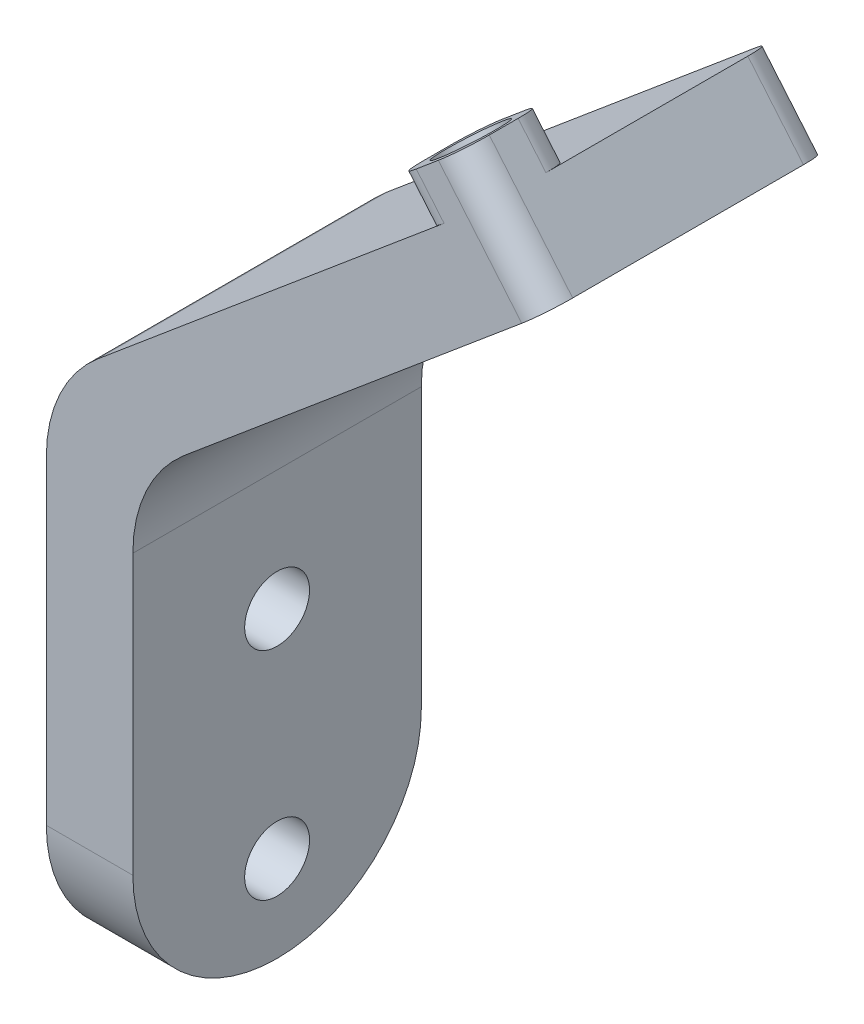
ISO-10303-21;
HEADER;
FILE_DESCRIPTION(('STEP AP214'),'2;1');
FILE_NAME('part.step','',(''),(''),'','','');
FILE_SCHEMA(('AUTOMOTIVE_DESIGN { 1 0 10303 214 1 1 1 1 }'));
ENDSEC;
DATA;
#1=APPLICATION_CONTEXT('core data for automotive mechanical design processes');
#2=APPLICATION_PROTOCOL_DEFINITION('international standard','automotive_design',2000,#1);
#3=PRODUCT_CONTEXT('',#1,'mechanical');
#4=PRODUCT('Part','Part','',(#3));
#5=PRODUCT_RELATED_PRODUCT_CATEGORY('part','',(#4));
#6=PRODUCT_DEFINITION_FORMATION('','',#4);
#7=PRODUCT_DEFINITION_CONTEXT('part definition',#1,'design');
#8=PRODUCT_DEFINITION('design','',#6,#7);
#9=PRODUCT_DEFINITION_SHAPE('','',#8);
#10=(LENGTH_UNIT() NAMED_UNIT(*) SI_UNIT(.MILLI.,.METRE.));
#11=(NAMED_UNIT(*) PLANE_ANGLE_UNIT() SI_UNIT($,.RADIAN.));
#12=(NAMED_UNIT(*) SI_UNIT($,.STERADIAN.) SOLID_ANGLE_UNIT());
#13=UNCERTAINTY_MEASURE_WITH_UNIT(LENGTH_MEASURE(1.E-05),#10,'distance_accuracy_value','');
#14=(GEOMETRIC_REPRESENTATION_CONTEXT(3) GLOBAL_UNCERTAINTY_ASSIGNED_CONTEXT((#13)) GLOBAL_UNIT_ASSIGNED_CONTEXT((#10,
#11,#12)) REPRESENTATION_CONTEXT('',''));
#15=CARTESIAN_POINT('',(0.,0.,0.));
#16=DIRECTION('',(0.,0.,1.));
#17=DIRECTION('',(1.,0.,0.));
#18=AXIS2_PLACEMENT_3D('',#15,#16,#17);
#19=CARTESIAN_POINT('',(0.,36.79784594893,-20.));
#20=DIRECTION('',(0.642787609686538,-0.766044443118979,0.));
#21=DIRECTION('',(0.766044443118979,0.642787609686538,0.));
#22=AXIS2_PLACEMENT_3D('',#19,#20,#21);
#23=PLANE('',#22);
#24=DIRECTION('',(-0.766044443118979,-0.642787609686538,0.));
#25=VECTOR('',#24,1.);
#26=CARTESIAN_POINT('',(0.,36.79784594893,-20.));
#27=LINE('',#26,#25);
#28=CARTESIAN_POINT('',(29.1096888385212,61.2237751170184,-20.));
#29=VERTEX_POINT('',#28);
#30=CARTESIAN_POINT('',(3.57212390313463,39.7952137985698,-20.));
#31=VERTEX_POINT('',#30);
#32=EDGE_CURVE('E317',#29,#31,#27,.T.);
#33=ORIENTED_EDGE('',*,*,#32,.T.);
#34=DIRECTION('',(0.,0.,1.));
#35=VECTOR('',#34,1.);
#36=CARTESIAN_POINT('',(3.57212390313463,39.7952137985698,-20.));
#37=LINE('',#36,#35);
#38=CARTESIAN_POINT('',(3.57212390313463,39.7952137985698,0.));
#39=VERTEX_POINT('',#38);
#40=EDGE_CURVE('E223',#39,#31,#37,.F.);
#41=ORIENTED_EDGE('',*,*,#40,.F.);
#42=DIRECTION('',(-0.766044443118979,-0.642787609686538,0.));
#43=VECTOR('',#42,1.);
#44=CARTESIAN_POINT('',(0.,36.79784594893,0.));
#45=LINE('',#44,#43);
#46=CARTESIAN_POINT('',(27.5775999522833,59.9381998976454,0.));
#47=VERTEX_POINT('',#46);
#48=EDGE_CURVE('E182',#47,#39,#45,.T.);
#49=ORIENTED_EDGE('',*,*,#48,.F.);
#50=CARTESIAN_POINT('',(27.5775999522833,59.9381998976454,-2.));
#51=DIRECTION('',(-0.642787609686538,0.766044443118979,0.));
#52=DIRECTION('',(0.766044443118979,0.642787609686538,0.));
#53=AXIS2_PLACEMENT_3D('',#50,#51,#52);
#54=CIRCLE('',#53,2.);
#55=CARTESIAN_POINT('',(26.0455110660453,58.6526246782723,-2.));
#56=VERTEX_POINT('',#55);
#57=EDGE_CURVE('E43',#56,#47,#54,.T.);
#58=ORIENTED_EDGE('',*,*,#57,.F.);
#59=DIRECTION('',(0.,0.,-1.));
#60=VECTOR('',#59,1.);
#61=CARTESIAN_POINT('',(26.0455110660453,58.6526246782723,-6.));
#62=LINE('',#61,#60);
#63=CARTESIAN_POINT('',(26.0455110660453,58.6526246782723,-4.));
#64=VERTEX_POINT('',#63);
#65=EDGE_CURVE('E298',#56,#64,#62,.T.);
#66=ORIENTED_EDGE('',*,*,#65,.T.);
#67=CARTESIAN_POINT('',(27.5775999522833,59.9381998976454,-4.));
#68=DIRECTION('',(-0.642787609686538,0.766044443118979,0.));
#69=DIRECTION('',(0.766044443118979,0.642787609686538,0.));
#70=AXIS2_PLACEMENT_3D('',#67,#68,#69);
#71=CIRCLE('',#70,2.);
#72=CARTESIAN_POINT('',(27.5775999522833,59.9381998976453,-6.));
#73=VERTEX_POINT('',#72);
#74=EDGE_CURVE('E11',#73,#64,#71,.T.);
#75=ORIENTED_EDGE('',*,*,#74,.F.);
#76=DIRECTION('',(0.766044443118979,0.642787609686538,0.));
#77=VECTOR('',#76,1.);
#78=CARTESIAN_POINT('',(30.6417777247592,62.5093503363915,-6.));
#79=LINE('',#78,#77);
#80=CARTESIAN_POINT('',(29.1096888385212,61.2237751170184,-6.));
#81=VERTEX_POINT('',#80);
#82=EDGE_CURVE('E291',#73,#81,#79,.T.);
#83=ORIENTED_EDGE('',*,*,#82,.T.);
#84=CARTESIAN_POINT('',(29.1096888385212,61.2237751170184,-4.));
#85=DIRECTION('',(-0.642787609686538,0.766044443118979,0.));
#86=DIRECTION('',(0.766044443118979,0.642787609686538,0.));
#87=AXIS2_PLACEMENT_3D('',#84,#85,#86);
#88=CIRCLE('',#87,2.);
#89=CARTESIAN_POINT('',(30.6417777247592,62.5093503363915,-4.));
#90=VERTEX_POINT('',#89);
#91=EDGE_CURVE('E267',#90,#81,#88,.T.);
#92=ORIENTED_EDGE('',*,*,#91,.F.);
#93=DIRECTION('',(0.,0.,1.));
#94=VECTOR('',#93,1.);
#95=CARTESIAN_POINT('',(30.6417777247592,62.5093503363915,-20.));
#96=LINE('',#95,#94);
#97=CARTESIAN_POINT('',(30.6417777247592,62.5093503363915,-18.));
#98=VERTEX_POINT('',#97);
#99=EDGE_CURVE('E193',#98,#90,#96,.T.);
#100=ORIENTED_EDGE('',*,*,#99,.F.);
#101=CARTESIAN_POINT('',(29.1096888385212,61.2237751170184,-18.));
#102=DIRECTION('',(-0.642787609686538,0.766044443118979,0.));
#103=DIRECTION('',(0.766044443118979,0.642787609686538,0.));
#104=AXIS2_PLACEMENT_3D('',#101,#102,#103);
#105=CIRCLE('',#104,2.);
#106=EDGE_CURVE('E265',#29,#98,#105,.F.);
#107=ORIENTED_EDGE('',*,*,#106,.F.);
#108=EDGE_LOOP('',(#33,#41,#49,#58,#66,#75,#83,#92,#100,#107));
#109=FACE_BOUND('',#108,.T.);
#110=ADVANCED_FACE('F35',(#109),#23,.F.);
#111=CARTESIAN_POINT('',(6.,34.,-20.));
#112=DIRECTION('',(-1.,0.,0.));
#113=DIRECTION('',(0.,-1.,0.));
#114=AXIS2_PLACEMENT_3D('',#111,#112,#113);
#115=PLANE('',#114);
#116=CARTESIAN_POINT('',(6.,21.,-10.));
#117=DIRECTION('',(1.,0.,0.));
#118=DIRECTION('',(0.,-1.,0.));
#119=AXIS2_PLACEMENT_3D('',#116,#117,#118);
#120=CIRCLE('',#119,2.25);
#121=CARTESIAN_POINT('',(6.,18.75,-10.));
#122=VERTEX_POINT('',#121);
#123=EDGE_CURVE('E305',#122,#122,#120,.T.);
#124=ORIENTED_EDGE('',*,*,#123,.F.);
#125=EDGE_LOOP('',(#124));
#126=FACE_BOUND('',#125,.T.);
#127=CARTESIAN_POINT('',(6.,6.,-10.));
#128=DIRECTION('',(1.,0.,0.));
#129=DIRECTION('',(0.,-1.,0.));
#130=AXIS2_PLACEMENT_3D('',#127,#128,#129);
#131=CIRCLE('',#130,2.25);
#132=CARTESIAN_POINT('',(6.,3.75,-10.));
#133=VERTEX_POINT('',#132);
#134=EDGE_CURVE('E186',#133,#133,#131,.T.);
#135=ORIENTED_EDGE('',*,*,#134,.F.);
#136=EDGE_LOOP('',(#135));
#137=FACE_BOUND('',#136,.T.);
#138=DIRECTION('',(0.,1.,0.));
#139=VECTOR('',#138,1.);
#140=CARTESIAN_POINT('',(6.,34.,0.));
#141=LINE('',#140,#139);
#142=CARTESIAN_POINT('',(6.,10.,0.));
#143=VERTEX_POINT('',#142);
#144=CARTESIAN_POINT('',(6.,29.33692341845,0.));
#145=VERTEX_POINT('',#144);
#146=EDGE_CURVE('E162',#143,#145,#141,.T.);
#147=ORIENTED_EDGE('',*,*,#146,.F.);
#148=CARTESIAN_POINT('',(6.,10.,-10.));
#149=DIRECTION('',(1.,0.,0.));
#150=DIRECTION('',(0.,-1.,0.));
#151=AXIS2_PLACEMENT_3D('',#148,#149,#150);
#152=CIRCLE('',#151,10.);
#153=CARTESIAN_POINT('',(6.,0.,-10.));
#154=VERTEX_POINT('',#153);
#155=EDGE_CURVE('E205',#154,#143,#152,.F.);
#156=ORIENTED_EDGE('',*,*,#155,.F.);
#157=CARTESIAN_POINT('',(6.,10.,-10.));
#158=DIRECTION('',(1.,0.,0.));
#159=DIRECTION('',(0.,-1.,0.));
#160=AXIS2_PLACEMENT_3D('',#157,#158,#159);
#161=CIRCLE('',#160,10.);
#162=CARTESIAN_POINT('',(6.,10.,-20.));
#163=VERTEX_POINT('',#162);
#164=EDGE_CURVE('E174',#163,#154,#161,.F.);
#165=ORIENTED_EDGE('',*,*,#164,.F.);
#166=DIRECTION('',(0.,1.,0.));
#167=VECTOR('',#166,1.);
#168=CARTESIAN_POINT('',(6.,34.,-20.));
#169=LINE('',#168,#167);
#170=CARTESIAN_POINT('',(6.,29.33692341845,-20.));
#171=VERTEX_POINT('',#170);
#172=EDGE_CURVE('E192',#163,#171,#169,.T.);
#173=ORIENTED_EDGE('',*,*,#172,.T.);
#174=DIRECTION('',(0.,0.,1.));
#175=VECTOR('',#174,1.);
#176=CARTESIAN_POINT('',(6.,29.33692341845,-20.));
#177=LINE('',#176,#175);
#178=EDGE_CURVE('E208',#145,#171,#177,.F.);
#179=ORIENTED_EDGE('',*,*,#178,.F.);
#180=EDGE_LOOP('',(#147,#156,#165,#173,#179));
#181=FACE_BOUND('',#180,.T.);
#182=ADVANCED_FACE('F335',(#126,#137,#181),#115,.F.);
#183=CARTESIAN_POINT('',(34.4985033828784,57.9130836776776,-20.));
#184=DIRECTION('',(-0.642787609686538,0.766044443118979,0.));
#185=DIRECTION('',(-0.766044443118979,-0.642787609686538,0.));
#186=AXIS2_PLACEMENT_3D('',#183,#184,#185);
#187=PLANE('',#186);
#188=CARTESIAN_POINT('',(32.2003700535215,55.9847208486181,-3.));
#189=DIRECTION('',(0.642787609686538,-0.766044443118979,0.));
#190=DIRECTION('',(-0.766044443118979,-0.642787609686538,0.));
#191=AXIS2_PLACEMENT_3D('',#188,#189,#190);
#192=CIRCLE('',#191,1.75);
#193=CARTESIAN_POINT('',(30.8597922780633,54.8598425316666,-3.));
#194=VERTEX_POINT('',#193);
#195=EDGE_CURVE('E200',#194,#194,#192,.T.);
#196=ORIENTED_EDGE('',*,*,#195,.F.);
#197=EDGE_LOOP('',(#196));
#198=FACE_BOUND('',#197,.T.);
#199=DIRECTION('',(0.766044443118979,0.642787609686538,0.));
#200=VECTOR('',#199,1.);
#201=CARTESIAN_POINT('',(34.4985033828784,57.9130836776776,0.));
#202=LINE('',#201,#200);
#203=CARTESIAN_POINT('',(9.57212390313463,36.9973678496398,0.));
#204=VERTEX_POINT('',#203);
#205=CARTESIAN_POINT('',(32.9664144966404,56.6275084583046,0.));
#206=VERTEX_POINT('',#205);
#207=EDGE_CURVE('E160',#204,#206,#202,.T.);
#208=ORIENTED_EDGE('',*,*,#207,.F.);
#209=DIRECTION('',(0.,0.,1.));
#210=VECTOR('',#209,1.);
#211=CARTESIAN_POINT('',(9.57212390313463,36.9973678496398,0.));
#212=LINE('',#211,#210);
#213=CARTESIAN_POINT('',(9.57212390313463,36.9973678496398,-20.));
#214=VERTEX_POINT('',#213);
#215=EDGE_CURVE('E170',#214,#204,#212,.T.);
#216=ORIENTED_EDGE('',*,*,#215,.F.);
#217=DIRECTION('',(0.766044443118979,0.642787609686538,0.));
#218=VECTOR('',#217,1.);
#219=CARTESIAN_POINT('',(34.4985033828784,57.9130836776776,-20.));
#220=LINE('',#219,#218);
#221=CARTESIAN_POINT('',(32.9664144966404,56.6275084583046,-20.));
#222=VERTEX_POINT('',#221);
#223=EDGE_CURVE('E315',#214,#222,#220,.T.);
#224=ORIENTED_EDGE('',*,*,#223,.T.);
#225=CARTESIAN_POINT('',(32.9664144966404,56.6275084583046,-18.));
#226=DIRECTION('',(0.642787609686538,-0.766044443118979,0.));
#227=DIRECTION('',(-0.766044443118979,-0.642787609686538,0.));
#228=AXIS2_PLACEMENT_3D('',#225,#226,#227);
#229=CIRCLE('',#228,2.);
#230=CARTESIAN_POINT('',(34.4985033828784,57.9130836776776,-18.));
#231=VERTEX_POINT('',#230);
#232=EDGE_CURVE('E261',#231,#222,#229,.F.);
#233=ORIENTED_EDGE('',*,*,#232,.F.);
#234=DIRECTION('',(0.,0.,1.));
#235=VECTOR('',#234,1.);
#236=CARTESIAN_POINT('',(34.4985033828784,57.9130836776776,-20.));
#237=LINE('',#236,#235);
#238=CARTESIAN_POINT('',(34.4985033828784,57.9130836776776,-2.));
#239=VERTEX_POINT('',#238);
#240=EDGE_CURVE('E175',#231,#239,#237,.T.);
#241=ORIENTED_EDGE('',*,*,#240,.T.);
#242=CARTESIAN_POINT('',(32.9664144966404,56.6275084583046,-2.));
#243=DIRECTION('',(0.642787609686538,-0.766044443118979,0.));
#244=DIRECTION('',(-0.766044443118979,-0.642787609686538,0.));
#245=AXIS2_PLACEMENT_3D('',#242,#243,#244);
#246=CIRCLE('',#245,2.);
#247=EDGE_CURVE('E181',#206,#239,#246,.F.);
#248=ORIENTED_EDGE('',*,*,#247,.F.);
#249=EDGE_LOOP('',(#208,#216,#224,#233,#241,#248));
#250=FACE_BOUND('',#249,.T.);
#251=ADVANCED_FACE('F178',(#198,#250),#187,.F.);
#252=CARTESIAN_POINT('',(30.6417777247592,62.5093503363915,-20.));
#253=DIRECTION('',(-0.76604444311898,-0.642787609686537,0.));
#254=DIRECTION('',(0.642787609686537,-0.76604444311898,0.));
#255=AXIS2_PLACEMENT_3D('',#252,#253,#254);
#256=PLANE('',#255);
#257=DIRECTION('',(0.,0.,1.));
#258=VECTOR('',#257,1.);
#259=CARTESIAN_POINT('',(28.7134148956996,64.8074836657484,-6.));
#260=LINE('',#259,#258);
#261=CARTESIAN_POINT('',(28.7134148956996,64.8074836657484,-4.));
#262=VERTEX_POINT('',#261);
#263=CARTESIAN_POINT('',(28.7134148956996,64.8074836657484,-2.));
#264=VERTEX_POINT('',#263);
#265=EDGE_CURVE('E285',#262,#264,#260,.T.);
#266=ORIENTED_EDGE('',*,*,#265,.T.);
#267=DIRECTION('',(-0.642787609686537,0.76604444311898,0.));
#268=VECTOR('',#267,1.);
#269=CARTESIAN_POINT('',(28.7134148956996,64.8074836657484,-2.));
#270=LINE('',#269,#268);
#271=EDGE_CURVE('E233',#239,#264,#270,.T.);
#272=ORIENTED_EDGE('',*,*,#271,.F.);
#273=ORIENTED_EDGE('',*,*,#240,.F.);
#274=DIRECTION('',(-0.642787609686537,0.76604444311898,0.));
#275=VECTOR('',#274,1.);
#276=CARTESIAN_POINT('',(30.6417777247592,62.5093503363915,-18.));
#277=LINE('',#276,#275);
#278=EDGE_CURVE('E230',#98,#231,#277,.F.);
#279=ORIENTED_EDGE('',*,*,#278,.F.);
#280=ORIENTED_EDGE('',*,*,#99,.T.);
#281=DIRECTION('',(0.642787609686537,-0.76604444311898,0.));
#282=VECTOR('',#281,1.);
#283=CARTESIAN_POINT('',(30.6417777247592,62.5093503363915,-4.));
#284=LINE('',#283,#282);
#285=EDGE_CURVE('E236',#262,#90,#284,.T.);
#286=ORIENTED_EDGE('',*,*,#285,.F.);
#287=EDGE_LOOP('',(#266,#272,#273,#279,#280,#286));
#288=FACE_BOUND('',#287,.T.);
#289=ADVANCED_FACE('F343',(#288),#256,.F.);
#290=CARTESIAN_POINT('',(0.,0.,-20.));
#291=DIRECTION('',(1.,0.,0.));
#292=DIRECTION('',(0.,0.,1.));
#293=AXIS2_PLACEMENT_3D('',#290,#291,#292);
#294=PLANE('',#293);
#295=CARTESIAN_POINT('',(0.,21.,-10.));
#296=DIRECTION('',(-1.,0.,0.));
#297=DIRECTION('',(0.,1.,0.));
#298=AXIS2_PLACEMENT_3D('',#295,#296,#297);
#299=CIRCLE('',#298,2.25);
#300=CARTESIAN_POINT('',(0.,23.25,-10.));
#301=VERTEX_POINT('',#300);
#302=EDGE_CURVE('E297',#301,#301,#299,.T.);
#303=ORIENTED_EDGE('',*,*,#302,.F.);
#304=EDGE_LOOP('',(#303));
#305=FACE_BOUND('',#304,.T.);
#306=CARTESIAN_POINT('',(0.,6.,-10.));
#307=DIRECTION('',(-1.,0.,0.));
#308=DIRECTION('',(0.,1.,0.));
#309=AXIS2_PLACEMENT_3D('',#306,#307,#308);
#310=CIRCLE('',#309,2.25);
#311=CARTESIAN_POINT('',(0.,8.25,-10.));
#312=VERTEX_POINT('',#311);
#313=EDGE_CURVE('E308',#312,#312,#310,.T.);
#314=ORIENTED_EDGE('',*,*,#313,.F.);
#315=EDGE_LOOP('',(#314));
#316=FACE_BOUND('',#315,.T.);
#317=DIRECTION('',(0.,-1.,0.));
#318=VECTOR('',#317,1.);
#319=CARTESIAN_POINT('',(0.,0.,-20.));
#320=LINE('',#319,#318);
#321=CARTESIAN_POINT('',(0.,32.13476936738,-20.));
#322=VERTEX_POINT('',#321);
#323=CARTESIAN_POINT('',(0.,10.,-20.));
#324=VERTEX_POINT('',#323);
#325=EDGE_CURVE('E196',#322,#324,#320,.T.);
#326=ORIENTED_EDGE('',*,*,#325,.T.);
#327=CARTESIAN_POINT('',(0.,10.,-10.));
#328=DIRECTION('',(-1.,0.,0.));
#329=DIRECTION('',(0.,0.,1.));
#330=AXIS2_PLACEMENT_3D('',#327,#328,#329);
#331=CIRCLE('',#330,10.);
#332=CARTESIAN_POINT('',(0.,0.,-10.));
#333=VERTEX_POINT('',#332);
#334=EDGE_CURVE('E210',#333,#324,#331,.F.);
#335=ORIENTED_EDGE('',*,*,#334,.F.);
#336=CARTESIAN_POINT('',(0.,10.,-10.));
#337=DIRECTION('',(-1.,0.,0.));
#338=DIRECTION('',(0.,0.,1.));
#339=AXIS2_PLACEMENT_3D('',#336,#337,#338);
#340=CIRCLE('',#339,10.);
#341=CARTESIAN_POINT('',(0.,10.,0.));
#342=VERTEX_POINT('',#341);
#343=EDGE_CURVE('E213',#342,#333,#340,.F.);
#344=ORIENTED_EDGE('',*,*,#343,.F.);
#345=DIRECTION('',(0.,-1.,0.));
#346=VECTOR('',#345,1.);
#347=CARTESIAN_POINT('',(0.,0.,0.));
#348=LINE('',#347,#346);
#349=CARTESIAN_POINT('',(0.,32.13476936738,0.));
#350=VERTEX_POINT('',#349);
#351=EDGE_CURVE('E184',#350,#342,#348,.T.);
#352=ORIENTED_EDGE('',*,*,#351,.F.);
#353=DIRECTION('',(0.,0.,1.));
#354=VECTOR('',#353,1.);
#355=CARTESIAN_POINT('',(0.,32.13476936738,-20.));
#356=LINE('',#355,#354);
#357=EDGE_CURVE('E216',#322,#350,#356,.T.);
#358=ORIENTED_EDGE('',*,*,#357,.F.);
#359=EDGE_LOOP('',(#326,#335,#344,#352,#358));
#360=FACE_BOUND('',#359,.T.);
#361=ADVANCED_FACE('F323',(#305,#316,#360),#294,.F.);
#362=CARTESIAN_POINT('',(0.,0.,-20.));
#363=DIRECTION('',(0.,0.,1.));
#364=DIRECTION('',(-1.,0.,0.));
#365=AXIS2_PLACEMENT_3D('',#362,#363,#364);
#366=PLANE('',#365);
#367=ORIENTED_EDGE('',*,*,#223,.F.);
#368=CARTESIAN_POINT('',(16.,29.33692341845,-20.));
#369=DIRECTION('',(0.,0.,-1.));
#370=DIRECTION('',(-1.,0.,0.));
#371=AXIS2_PLACEMENT_3D('',#368,#369,#370);
#372=CIRCLE('',#371,10.);
#373=EDGE_CURVE('E166',#171,#214,#372,.T.);
#374=ORIENTED_EDGE('',*,*,#373,.F.);
#375=ORIENTED_EDGE('',*,*,#172,.F.);
#376=DIRECTION('',(1.,0.,0.));
#377=VECTOR('',#376,1.);
#378=CARTESIAN_POINT('',(0.,10.,-20.));
#379=LINE('',#378,#377);
#380=EDGE_CURVE('E226',#324,#163,#379,.T.);
#381=ORIENTED_EDGE('',*,*,#380,.F.);
#382=ORIENTED_EDGE('',*,*,#325,.F.);
#383=CARTESIAN_POINT('',(10.,32.13476936738,-20.));
#384=DIRECTION('',(0.,0.,-1.));
#385=DIRECTION('',(-1.,0.,0.));
#386=AXIS2_PLACEMENT_3D('',#383,#384,#385);
#387=CIRCLE('',#386,10.);
#388=EDGE_CURVE('E167',#31,#322,#387,.F.);
#389=ORIENTED_EDGE('',*,*,#388,.F.);
#390=ORIENTED_EDGE('',*,*,#32,.F.);
#391=DIRECTION('',(-0.642787609686537,0.76604444311898,0.));
#392=VECTOR('',#391,1.);
#393=CARTESIAN_POINT('',(47.2290908308488,39.6299126970032,-20.));
#394=LINE('',#393,#392);
#395=EDGE_CURVE('E50',#222,#29,#394,.T.);
#396=ORIENTED_EDGE('',*,*,#395,.F.);
#397=EDGE_LOOP('',(#367,#374,#375,#381,#382,#389,#390,#396));
#398=FACE_BOUND('',#397,.T.);
#399=ADVANCED_FACE('F326',(#398),#366,.F.);
#400=CARTESIAN_POINT('',(0.,0.,0.));
#401=DIRECTION('',(0.,0.,1.));
#402=DIRECTION('',(-1.,0.,0.));
#403=AXIS2_PLACEMENT_3D('',#400,#401,#402);
#404=PLANE('',#403);
#405=ORIENTED_EDGE('',*,*,#48,.T.);
#406=CARTESIAN_POINT('',(10.,32.13476936738,0.));
#407=DIRECTION('',(0.,0.,-1.));
#408=DIRECTION('',(-1.,0.,0.));
#409=AXIS2_PLACEMENT_3D('',#406,#407,#408);
#410=CIRCLE('',#409,10.);
#411=EDGE_CURVE('E221',#350,#39,#410,.T.);
#412=ORIENTED_EDGE('',*,*,#411,.F.);
#413=ORIENTED_EDGE('',*,*,#351,.T.);
#414=DIRECTION('',(1.,0.,0.));
#415=VECTOR('',#414,1.);
#416=CARTESIAN_POINT('',(0.,10.,0.));
#417=LINE('',#416,#415);
#418=EDGE_CURVE('E219',#143,#342,#417,.F.);
#419=ORIENTED_EDGE('',*,*,#418,.F.);
#420=ORIENTED_EDGE('',*,*,#146,.T.);
#421=CARTESIAN_POINT('',(16.,29.33692341845,0.));
#422=DIRECTION('',(0.,0.,-1.));
#423=DIRECTION('',(-1.,0.,0.));
#424=AXIS2_PLACEMENT_3D('',#421,#422,#423);
#425=CIRCLE('',#424,10.);
#426=EDGE_CURVE('E154',#204,#145,#425,.F.);
#427=ORIENTED_EDGE('',*,*,#426,.F.);
#428=ORIENTED_EDGE('',*,*,#207,.T.);
#429=DIRECTION('',(-0.642787609686537,0.76604444311898,0.));
#430=VECTOR('',#429,1.);
#431=CARTESIAN_POINT('',(32.9664144966404,56.6275084583046,0.));
#432=LINE('',#431,#430);
#433=CARTESIAN_POINT('',(27.1813260094616,63.5219084463754,0.));
#434=VERTEX_POINT('',#433);
#435=EDGE_CURVE('E256',#434,#206,#432,.F.);
#436=ORIENTED_EDGE('',*,*,#435,.F.);
#437=DIRECTION('',(-0.766044443118979,-0.642787609686538,0.));
#438=VECTOR('',#437,1.);
#439=CARTESIAN_POINT('',(28.7134148956996,64.8074836657484,0.));
#440=LINE('',#439,#438);
#441=CARTESIAN_POINT('',(25.6492371232237,62.2363332270023,0.));
#442=VERTEX_POINT('',#441);
#443=EDGE_CURVE('E282',#434,#442,#440,.T.);
#444=ORIENTED_EDGE('',*,*,#443,.T.);
#445=DIRECTION('',(0.642787609686537,-0.76604444311898,0.));
#446=VECTOR('',#445,1.);
#447=CARTESIAN_POINT('',(25.6492371232237,62.2363332270023,0.));
#448=LINE('',#447,#446);
#449=EDGE_CURVE('E258',#47,#442,#448,.F.);
#450=ORIENTED_EDGE('',*,*,#449,.F.);
#451=EDGE_LOOP('',(#405,#412,#413,#419,#420,#427,#428,#436,#444,#450));
#452=FACE_BOUND('',#451,.T.);
#453=ADVANCED_FACE('F157',(#452),#404,.T.);
#454=CARTESIAN_POINT('',(0.,6.,-10.));
#455=DIRECTION('',(1.,0.,0.));
#456=DIRECTION('',(0.,1.,0.));
#457=AXIS2_PLACEMENT_3D('',#454,#455,#456);
#458=CYLINDRICAL_SURFACE('',#457,2.25);
#459=ORIENTED_EDGE('',*,*,#313,.T.);
#460=EDGE_LOOP('',(#459));
#461=FACE_BOUND('',#460,.T.);
#462=ORIENTED_EDGE('',*,*,#134,.T.);
#463=EDGE_LOOP('',(#462));
#464=FACE_BOUND('',#463,.T.);
#465=ADVANCED_FACE('F402',(#461,#464),#458,.F.);
#466=CARTESIAN_POINT('',(0.,21.,-10.));
#467=DIRECTION('',(1.,0.,0.));
#468=DIRECTION('',(0.,1.,0.));
#469=AXIS2_PLACEMENT_3D('',#466,#467,#468);
#470=CYLINDRICAL_SURFACE('',#469,2.25);
#471=ORIENTED_EDGE('',*,*,#302,.T.);
#472=EDGE_LOOP('',(#471));
#473=FACE_BOUND('',#472,.T.);
#474=ORIENTED_EDGE('',*,*,#123,.T.);
#475=EDGE_LOOP('',(#474));
#476=FACE_BOUND('',#475,.T.);
#477=ADVANCED_FACE('F395',(#473,#476),#470,.F.);
#478=CARTESIAN_POINT('',(24.1171482369857,60.9507580076292,-6.));
#479=DIRECTION('',(0.76604444311898,0.642787609686537,0.));
#480=DIRECTION('',(-0.642787609686537,0.76604444311898,0.));
#481=AXIS2_PLACEMENT_3D('',#478,#479,#480);
#482=PLANE('',#481);
#483=DIRECTION('',(0.,0.,-1.));
#484=VECTOR('',#483,1.);
#485=CARTESIAN_POINT('',(24.1171482369857,60.9507580076292,-6.));
#486=LINE('',#485,#484);
#487=CARTESIAN_POINT('',(24.1171482369857,60.9507580076292,-2.));
#488=VERTEX_POINT('',#487);
#489=CARTESIAN_POINT('',(24.1171482369857,60.9507580076292,-4.));
#490=VERTEX_POINT('',#489);
#491=EDGE_CURVE('E284',#488,#490,#486,.T.);
#492=ORIENTED_EDGE('',*,*,#491,.T.);
#493=DIRECTION('',(0.642787609686537,-0.76604444311898,0.));
#494=VECTOR('',#493,1.);
#495=CARTESIAN_POINT('',(24.1171482369857,60.9507580076292,-4.));
#496=LINE('',#495,#494);
#497=EDGE_CURVE('E251',#64,#490,#496,.F.);
#498=ORIENTED_EDGE('',*,*,#497,.F.);
#499=ORIENTED_EDGE('',*,*,#65,.F.);
#500=DIRECTION('',(0.642787609686537,-0.76604444311898,0.));
#501=VECTOR('',#500,1.);
#502=CARTESIAN_POINT('',(26.0455110660453,58.6526246782723,-2.));
#503=LINE('',#502,#501);
#504=EDGE_CURVE('E254',#488,#56,#503,.T.);
#505=ORIENTED_EDGE('',*,*,#504,.F.);
#506=EDGE_LOOP('',(#492,#498,#499,#505));
#507=FACE_BOUND('',#506,.T.);
#508=ADVANCED_FACE('F392',(#507),#482,.F.);
#509=CARTESIAN_POINT('',(28.7134148956996,64.8074836657484,-6.));
#510=DIRECTION('',(0.,0.,1.));
#511=DIRECTION('',(-1.,0.,0.));
#512=AXIS2_PLACEMENT_3D('',#509,#510,#511);
#513=PLANE('',#512);
#514=ORIENTED_EDGE('',*,*,#82,.F.);
#515=DIRECTION('',(0.642787609686537,-0.76604444311898,0.));
#516=VECTOR('',#515,1.);
#517=CARTESIAN_POINT('',(25.6492371232237,62.2363332270023,-6.));
#518=LINE('',#517,#516);
#519=CARTESIAN_POINT('',(25.6492371232237,62.2363332270023,-6.));
#520=VERTEX_POINT('',#519);
#521=EDGE_CURVE('E238',#520,#73,#518,.T.);
#522=ORIENTED_EDGE('',*,*,#521,.F.);
#523=DIRECTION('',(0.766044443118979,0.642787609686538,0.));
#524=VECTOR('',#523,1.);
#525=CARTESIAN_POINT('',(28.7134148956996,64.8074836657484,-6.));
#526=LINE('',#525,#524);
#527=CARTESIAN_POINT('',(27.1813260094616,63.5219084463754,-6.));
#528=VERTEX_POINT('',#527);
#529=EDGE_CURVE('E288',#520,#528,#526,.T.);
#530=ORIENTED_EDGE('',*,*,#529,.T.);
#531=DIRECTION('',(0.642787609686537,-0.76604444311898,0.));
#532=VECTOR('',#531,1.);
#533=CARTESIAN_POINT('',(27.1813260094616,63.5219084463754,-6.));
#534=LINE('',#533,#532);
#535=EDGE_CURVE('E240',#81,#528,#534,.F.);
#536=ORIENTED_EDGE('',*,*,#535,.F.);
#537=EDGE_LOOP('',(#514,#522,#530,#536));
#538=FACE_BOUND('',#537,.T.);
#539=ADVANCED_FACE('F388',(#538),#513,.F.);
#540=CARTESIAN_POINT('',(-20.0477648213871,23.891995749372,0.));
#541=DIRECTION('',(-0.642787609686538,0.766044443118979,0.));
#542=DIRECTION('',(-0.766044443118979,-0.642787609686538,0.));
#543=AXIS2_PLACEMENT_3D('',#540,#541,#542);
#544=PLANE('',#543);
#545=CARTESIAN_POINT('',(26.4152815663427,62.8791208366888,-3.));
#546=DIRECTION('',(0.642787609686538,-0.766044443118979,0.));
#547=DIRECTION('',(-0.766044443118979,-0.642787609686538,0.));
#548=AXIS2_PLACEMENT_3D('',#545,#546,#547);
#549=CIRCLE('',#548,2.24999999999998);
#550=CARTESIAN_POINT('',(24.691681569325,61.4328487148941,-3.));
#551=VERTEX_POINT('',#550);
#552=EDGE_CURVE('E548',#551,#551,#549,.T.);
#553=ORIENTED_EDGE('',*,*,#552,.T.);
#554=EDGE_LOOP('',(#553));
#555=FACE_BOUND('',#554,.T.);
#556=ORIENTED_EDGE('',*,*,#529,.F.);
#557=CARTESIAN_POINT('',(25.6492371232237,62.2363332270023,-4.));
#558=DIRECTION('',(0.642787609686538,-0.766044443118979,0.));
#559=DIRECTION('',(-0.766044443118979,-0.642787609686538,0.));
#560=AXIS2_PLACEMENT_3D('',#557,#558,#559);
#561=CIRCLE('',#560,2.);
#562=EDGE_CURVE('E245',#490,#520,#561,.T.);
#563=ORIENTED_EDGE('',*,*,#562,.F.);
#564=ORIENTED_EDGE('',*,*,#491,.F.);
#565=CARTESIAN_POINT('',(25.6492371232237,62.2363332270023,-2.));
#566=DIRECTION('',(0.642787609686538,-0.766044443118979,0.));
#567=DIRECTION('',(-0.766044443118979,-0.642787609686538,0.));
#568=AXIS2_PLACEMENT_3D('',#565,#566,#567);
#569=CIRCLE('',#568,2.);
#570=EDGE_CURVE('E247',#442,#488,#569,.T.);
#571=ORIENTED_EDGE('',*,*,#570,.F.);
#572=ORIENTED_EDGE('',*,*,#443,.F.);
#573=CARTESIAN_POINT('',(27.1813260094616,63.5219084463754,-2.));
#574=DIRECTION('',(0.642787609686538,-0.766044443118979,0.));
#575=DIRECTION('',(-0.766044443118979,-0.642787609686538,0.));
#576=AXIS2_PLACEMENT_3D('',#573,#574,#575);
#577=CIRCLE('',#576,2.);
#578=EDGE_CURVE('E243',#264,#434,#577,.T.);
#579=ORIENTED_EDGE('',*,*,#578,.F.);
#580=ORIENTED_EDGE('',*,*,#265,.F.);
#581=CARTESIAN_POINT('',(27.1813260094616,63.5219084463754,-4.));
#582=DIRECTION('',(0.642787609686538,-0.766044443118979,0.));
#583=DIRECTION('',(-0.766044443118979,-0.642787609686538,0.));
#584=AXIS2_PLACEMENT_3D('',#581,#582,#583);
#585=CIRCLE('',#584,2.);
#586=EDGE_CURVE('E249',#528,#262,#585,.T.);
#587=ORIENTED_EDGE('',*,*,#586,.F.);
#588=EDGE_LOOP('',(#556,#563,#564,#571,#572,#579,#580,#587));
#589=FACE_BOUND('',#588,.T.);
#590=ADVANCED_FACE('F383',(#555,#589),#544,.T.);
#591=CARTESIAN_POINT('',(29.6292196147754,59.0488986210939,-3.));
#592=DIRECTION('',(-0.642787609686538,0.766044443118979,0.));
#593=DIRECTION('',(-0.766044443118979,-0.642787609686538,0.));
#594=AXIS2_PLACEMENT_3D('',#591,#592,#593);
#595=CYLINDRICAL_SURFACE('',#594,2.24999999999998);
#596=CARTESIAN_POINT('',(29.6292196147754,59.0488986210939,-3.));
#597=DIRECTION('',(0.642787609686538,-0.766044443118979,0.));
#598=DIRECTION('',(-0.766044443118979,-0.642787609686538,0.));
#599=AXIS2_PLACEMENT_3D('',#596,#597,#598);
#600=CIRCLE('',#599,2.24999999999998);
#601=CARTESIAN_POINT('',(27.9056196177577,57.6026264992992,-3.));
#602=VERTEX_POINT('',#601);
#603=EDGE_CURVE('E300',#602,#602,#600,.T.);
#604=ORIENTED_EDGE('',*,*,#603,.T.);
#605=EDGE_LOOP('',(#604));
#606=FACE_BOUND('',#605,.T.);
#607=ORIENTED_EDGE('',*,*,#552,.F.);
#608=EDGE_LOOP('',(#607));
#609=FACE_BOUND('',#608,.T.);
#610=ADVANCED_FACE('F460',(#606,#609),#595,.F.);
#611=CARTESIAN_POINT('',(29.6292196147754,59.0488986210939,-3.));
#612=DIRECTION('',(-0.642787609686538,0.766044443118979,0.));
#613=DIRECTION('',(-0.766044443118979,-0.642787609686538,0.));
#614=AXIS2_PLACEMENT_3D('',#611,#612,#613);
#615=PLANE('',#614);
#616=CARTESIAN_POINT('',(29.6292196147754,59.0488986210939,-3.));
#617=DIRECTION('',(0.642787609686538,-0.766044443118979,0.));
#618=DIRECTION('',(-0.766044443118979,-0.642787609686538,0.));
#619=AXIS2_PLACEMENT_3D('',#616,#617,#618);
#620=CIRCLE('',#619,1.75);
#621=CARTESIAN_POINT('',(28.2886418393172,57.9240203041425,-3.));
#622=VERTEX_POINT('',#621);
#623=EDGE_CURVE('E198',#622,#622,#620,.T.);
#624=ORIENTED_EDGE('',*,*,#623,.T.);
#625=EDGE_LOOP('',(#624));
#626=FACE_BOUND('',#625,.T.);
#627=ORIENTED_EDGE('',*,*,#603,.F.);
#628=EDGE_LOOP('',(#627));
#629=FACE_BOUND('',#628,.T.);
#630=ADVANCED_FACE('F469',(#626,#629),#615,.T.);
#631=CARTESIAN_POINT('',(60.7169969568323,21.9999282879286,-3.));
#632=DIRECTION('',(-0.642787609686538,0.766044443118979,0.));
#633=DIRECTION('',(-0.766044443118979,-0.642787609686538,0.));
#634=AXIS2_PLACEMENT_3D('',#631,#632,#633);
#635=CYLINDRICAL_SURFACE('',#634,1.75);
#636=ORIENTED_EDGE('',*,*,#623,.F.);
#637=EDGE_LOOP('',(#636));
#638=FACE_BOUND('',#637,.T.);
#639=ORIENTED_EDGE('',*,*,#195,.T.);
#640=EDGE_LOOP('',(#639));
#641=FACE_BOUND('',#640,.T.);
#642=ADVANCED_FACE('F354',(#638,#641),#635,.F.);
#643=CARTESIAN_POINT('',(16.,29.33692341845,-20.));
#644=DIRECTION('',(0.,0.,-1.));
#645=DIRECTION('',(1.,0.,0.));
#646=AXIS2_PLACEMENT_3D('',#643,#644,#645);
#647=CYLINDRICAL_SURFACE('',#646,10.);
#648=ORIENTED_EDGE('',*,*,#373,.T.);
#649=ORIENTED_EDGE('',*,*,#215,.T.);
#650=ORIENTED_EDGE('',*,*,#426,.T.);
#651=ORIENTED_EDGE('',*,*,#178,.T.);
#652=EDGE_LOOP('',(#648,#649,#650,#651));
#653=FACE_BOUND('',#652,.T.);
#654=ADVANCED_FACE('F171',(#653),#647,.F.);
#655=CARTESIAN_POINT('',(10.,32.13476936738,-20.));
#656=DIRECTION('',(0.,0.,1.));
#657=DIRECTION('',(-1.,0.,0.));
#658=AXIS2_PLACEMENT_3D('',#655,#656,#657);
#659=CYLINDRICAL_SURFACE('',#658,10.);
#660=ORIENTED_EDGE('',*,*,#388,.T.);
#661=ORIENTED_EDGE('',*,*,#357,.T.);
#662=ORIENTED_EDGE('',*,*,#411,.T.);
#663=ORIENTED_EDGE('',*,*,#40,.T.);
#664=EDGE_LOOP('',(#660,#661,#662,#663));
#665=FACE_BOUND('',#664,.T.);
#666=ADVANCED_FACE('F353',(#665),#659,.T.);
#667=CARTESIAN_POINT('',(0.,10.,-10.));
#668=DIRECTION('',(1.,0.,0.));
#669=DIRECTION('',(0.,1.,0.));
#670=AXIS2_PLACEMENT_3D('',#667,#668,#669);
#671=CYLINDRICAL_SURFACE('',#670,10.);
#672=ORIENTED_EDGE('',*,*,#380,.T.);
#673=ORIENTED_EDGE('',*,*,#164,.T.);
#674=DIRECTION('',(1.,0.,0.));
#675=VECTOR('',#674,1.);
#676=CARTESIAN_POINT('',(6.,0.,-10.));
#677=LINE('',#676,#675);
#678=EDGE_CURVE('E201',#154,#333,#677,.F.);
#679=ORIENTED_EDGE('',*,*,#678,.T.);
#680=ORIENTED_EDGE('',*,*,#334,.T.);
#681=EDGE_LOOP('',(#672,#673,#679,#680));
#682=FACE_BOUND('',#681,.T.);
#683=ADVANCED_FACE('F330',(#682),#671,.T.);
#684=CARTESIAN_POINT('',(6.,10.,-10.));
#685=DIRECTION('',(-1.,0.,0.));
#686=DIRECTION('',(0.,-1.,0.));
#687=AXIS2_PLACEMENT_3D('',#684,#685,#686);
#688=CYLINDRICAL_SURFACE('',#687,10.);
#689=ORIENTED_EDGE('',*,*,#343,.T.);
#690=ORIENTED_EDGE('',*,*,#678,.F.);
#691=ORIENTED_EDGE('',*,*,#155,.T.);
#692=ORIENTED_EDGE('',*,*,#418,.T.);
#693=EDGE_LOOP('',(#689,#690,#691,#692));
#694=FACE_BOUND('',#693,.T.);
#695=ADVANCED_FACE('F333',(#694),#688,.T.);
#696=CARTESIAN_POINT('',(29.1096888385212,61.2237751170184,-4.));
#697=DIRECTION('',(0.642787609686537,-0.76604444311898,0.));
#698=DIRECTION('',(0.76604444311898,0.642787609686537,0.));
#699=AXIS2_PLACEMENT_3D('',#696,#697,#698);
#700=CYLINDRICAL_SURFACE('',#699,2.);
#701=ORIENTED_EDGE('',*,*,#586,.T.);
#702=ORIENTED_EDGE('',*,*,#285,.T.);
#703=ORIENTED_EDGE('',*,*,#91,.T.);
#704=ORIENTED_EDGE('',*,*,#535,.T.);
#705=EDGE_LOOP('',(#701,#702,#703,#704));
#706=FACE_BOUND('',#705,.T.);
#707=ADVANCED_FACE('F360',(#706),#700,.T.);
#708=CARTESIAN_POINT('',(25.6492371232237,62.2363332270023,-2.));
#709=DIRECTION('',(-0.642787609686537,0.76604444311898,0.));
#710=DIRECTION('',(-0.76604444311898,-0.642787609686537,0.));
#711=AXIS2_PLACEMENT_3D('',#708,#709,#710);
#712=CYLINDRICAL_SURFACE('',#711,2.);
#713=ORIENTED_EDGE('',*,*,#570,.T.);
#714=ORIENTED_EDGE('',*,*,#504,.T.);
#715=ORIENTED_EDGE('',*,*,#57,.T.);
#716=ORIENTED_EDGE('',*,*,#449,.T.);
#717=EDGE_LOOP('',(#713,#714,#715,#716));
#718=FACE_BOUND('',#717,.T.);
#719=ADVANCED_FACE('F273',(#718),#712,.T.);
#720=CARTESIAN_POINT('',(25.6492371232237,62.2363332270023,-4.));
#721=DIRECTION('',(0.642787609686537,-0.76604444311898,0.));
#722=DIRECTION('',(0.76604444311898,0.642787609686537,0.));
#723=AXIS2_PLACEMENT_3D('',#720,#721,#722);
#724=CYLINDRICAL_SURFACE('',#723,2.);
#725=ORIENTED_EDGE('',*,*,#562,.T.);
#726=ORIENTED_EDGE('',*,*,#521,.T.);
#727=ORIENTED_EDGE('',*,*,#74,.T.);
#728=ORIENTED_EDGE('',*,*,#497,.T.);
#729=EDGE_LOOP('',(#725,#726,#727,#728));
#730=FACE_BOUND('',#729,.T.);
#731=ADVANCED_FACE('F368',(#730),#724,.T.);
#732=CARTESIAN_POINT('',(29.1096888385212,61.2237751170184,-2.));
#733=DIRECTION('',(0.642787609686537,-0.76604444311898,0.));
#734=DIRECTION('',(0.76604444311898,0.642787609686537,0.));
#735=AXIS2_PLACEMENT_3D('',#732,#733,#734);
#736=CYLINDRICAL_SURFACE('',#735,2.);
#737=ORIENTED_EDGE('',*,*,#247,.T.);
#738=ORIENTED_EDGE('',*,*,#271,.T.);
#739=ORIENTED_EDGE('',*,*,#578,.T.);
#740=ORIENTED_EDGE('',*,*,#435,.T.);
#741=EDGE_LOOP('',(#737,#738,#739,#740));
#742=FACE_BOUND('',#741,.T.);
#743=ADVANCED_FACE('F370',(#742),#736,.T.);
#744=CARTESIAN_POINT('',(47.2290908308488,39.6299126970032,-18.));
#745=DIRECTION('',(-0.642787609686537,0.76604444311898,0.));
#746=DIRECTION('',(-0.76604444311898,-0.642787609686537,0.));
#747=AXIS2_PLACEMENT_3D('',#744,#745,#746);
#748=CYLINDRICAL_SURFACE('',#747,2.);
#749=ORIENTED_EDGE('',*,*,#232,.T.);
#750=ORIENTED_EDGE('',*,*,#395,.T.);
#751=ORIENTED_EDGE('',*,*,#106,.T.);
#752=ORIENTED_EDGE('',*,*,#278,.T.);
#753=EDGE_LOOP('',(#749,#750,#751,#752));
#754=FACE_BOUND('',#753,.T.);
#755=ADVANCED_FACE('F37',(#754),#748,.T.);
#756=CLOSED_SHELL('',(#110,#182,#251,#289,#361,#399,#453,#465,#477,#508,#539,#590,#610,#630,
#642,#654,#666,#683,#695,#707,#719,#731,#743,#755));
#757=MANIFOLD_SOLID_BREP('B2',#756);
#758=ADVANCED_BREP_SHAPE_REPRESENTATION('',(#18,#757),#14);
#759=SHAPE_DEFINITION_REPRESENTATION(#9,#758);
ENDSEC;
END-ISO-10303-21;
